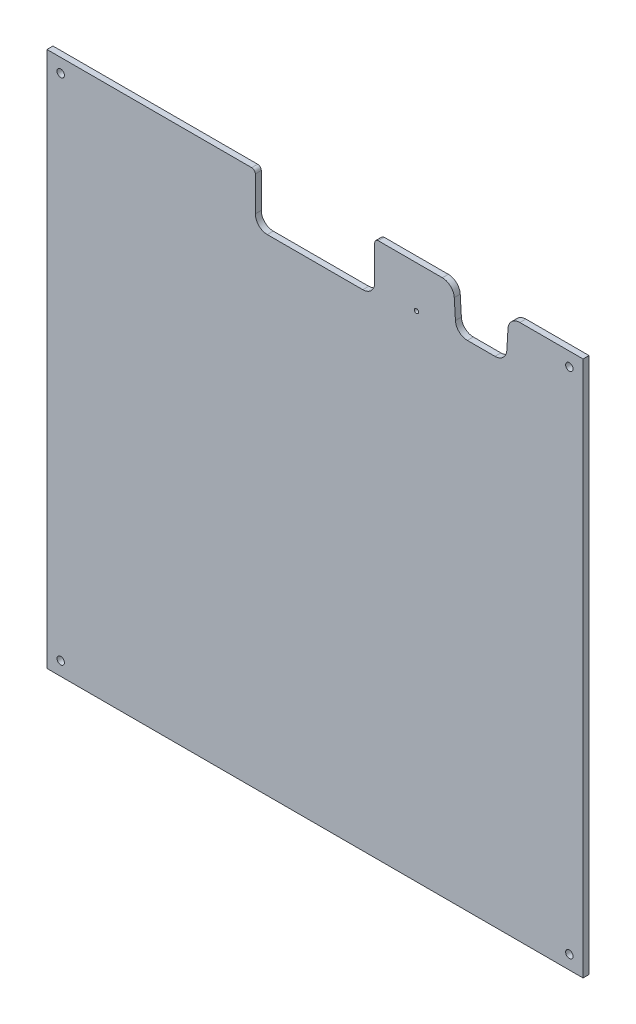
ISO-10303-21;
HEADER;
FILE_DESCRIPTION(('STEP AP214'),'2;1');
FILE_NAME('part.step','',(''),(''),'','','');
FILE_SCHEMA(('AUTOMOTIVE_DESIGN { 1 0 10303 214 1 1 1 1 }'));
ENDSEC;
DATA;
#1=APPLICATION_CONTEXT('core data for automotive mechanical design processes');
#2=APPLICATION_PROTOCOL_DEFINITION('international standard','automotive_design',2000,#1);
#3=PRODUCT_CONTEXT('',#1,'mechanical');
#4=PRODUCT('Part','Part','',(#3));
#5=PRODUCT_RELATED_PRODUCT_CATEGORY('part','',(#4));
#6=PRODUCT_DEFINITION_FORMATION('','',#4);
#7=PRODUCT_DEFINITION_CONTEXT('part definition',#1,'design');
#8=PRODUCT_DEFINITION('design','',#6,#7);
#9=PRODUCT_DEFINITION_SHAPE('','',#8);
#10=(LENGTH_UNIT() NAMED_UNIT(*) SI_UNIT(.MILLI.,.METRE.));
#11=(NAMED_UNIT(*) PLANE_ANGLE_UNIT() SI_UNIT($,.RADIAN.));
#12=(NAMED_UNIT(*) SI_UNIT($,.STERADIAN.) SOLID_ANGLE_UNIT());
#13=UNCERTAINTY_MEASURE_WITH_UNIT(LENGTH_MEASURE(1.E-05),#10,'distance_accuracy_value','');
#14=(GEOMETRIC_REPRESENTATION_CONTEXT(3) GLOBAL_UNCERTAINTY_ASSIGNED_CONTEXT((#13)) GLOBAL_UNIT_ASSIGNED_CONTEXT((#10,
#11,#12)) REPRESENTATION_CONTEXT('',''));
#15=CARTESIAN_POINT('',(0.,0.,0.));
#16=DIRECTION('',(0.,0.,1.));
#17=DIRECTION('',(1.,0.,0.));
#18=AXIS2_PLACEMENT_3D('',#15,#16,#17);
#19=CARTESIAN_POINT('',(171.5,446.,5.));
#20=DIRECTION('',(0.,0.,1.));
#21=DIRECTION('',(1.,0.,0.));
#22=AXIS2_PLACEMENT_3D('',#19,#20,#21);
#23=PLANE('',#22);
#24=CARTESIAN_POINT('',(11.5,437.5,5.));
#25=DIRECTION('',(0.,0.,1.));
#26=DIRECTION('',(-1.,0.,0.));
#27=AXIS2_PLACEMENT_3D('',#24,#25,#26);
#28=CIRCLE('',#27,3.1);
#29=CARTESIAN_POINT('',(8.4,437.5,5.));
#30=VERTEX_POINT('',#29);
#31=EDGE_CURVE('E490',#30,#30,#28,.T.);
#32=ORIENTED_EDGE('',*,*,#31,.F.);
#33=EDGE_LOOP('',(#32));
#34=FACE_BOUND('',#33,.T.);
#35=CARTESIAN_POINT('',(437.5,11.5,5.));
#36=DIRECTION('',(0.,0.,1.));
#37=DIRECTION('',(-1.,0.,0.));
#38=AXIS2_PLACEMENT_3D('',#35,#36,#37);
#39=CIRCLE('',#38,3.09999999999999);
#40=CARTESIAN_POINT('',(434.4,11.5,5.));
#41=VERTEX_POINT('',#40);
#42=EDGE_CURVE('E503',#41,#41,#39,.T.);
#43=ORIENTED_EDGE('',*,*,#42,.F.);
#44=EDGE_LOOP('',(#43));
#45=FACE_BOUND('',#44,.T.);
#46=DIRECTION('',(1.,0.,0.));
#47=VECTOR('',#46,1.);
#48=CARTESIAN_POINT('',(449.,0.,5.));
#49=LINE('',#48,#47);
#50=CARTESIAN_POINT('',(0.,0.,5.));
#51=VERTEX_POINT('',#50);
#52=CARTESIAN_POINT('',(449.,0.,5.));
#53=VERTEX_POINT('',#52);
#54=EDGE_CURVE('E293',#51,#53,#49,.T.);
#55=ORIENTED_EDGE('',*,*,#54,.T.);
#56=DIRECTION('',(0.,1.,0.));
#57=VECTOR('',#56,1.);
#58=CARTESIAN_POINT('',(449.,449.,5.));
#59=LINE('',#58,#57);
#60=CARTESIAN_POINT('',(449.,449.,5.));
#61=VERTEX_POINT('',#60);
#62=EDGE_CURVE('E145',#53,#61,#59,.T.);
#63=ORIENTED_EDGE('',*,*,#62,.T.);
#64=DIRECTION('',(-1.,0.,0.));
#65=VECTOR('',#64,1.);
#66=CARTESIAN_POINT('',(396.110585001908,449.,5.));
#67=LINE('',#66,#65);
#68=CARTESIAN_POINT('',(396.110585001908,449.,5.));
#69=VERTEX_POINT('',#68);
#70=EDGE_CURVE('E362',#61,#69,#67,.T.);
#71=ORIENTED_EDGE('',*,*,#70,.T.);
#72=CARTESIAN_POINT('',(396.110585001908,439.,5.));
#73=DIRECTION('',(0.,0.,1.));
#74=DIRECTION('',(-1.,0.,0.));
#75=AXIS2_PLACEMENT_3D('',#72,#73,#74);
#76=CIRCLE('',#75,10.);
#77=CARTESIAN_POINT('',(386.128274438066,439.594538314174,5.));
#78=VERTEX_POINT('',#77);
#79=EDGE_CURVE('E382',#69,#78,#76,.T.);
#80=ORIENTED_EDGE('',*,*,#79,.T.);
#81=DIRECTION('',(-0.059453831417346,-0.998231056384141,0.));
#82=VECTOR('',#81,1.);
#83=CARTESIAN_POINT('',(386.128274438066,439.594538314174,5.));
#84=LINE('',#83,#82);
#85=CARTESIAN_POINT('',(385.164066175351,423.405461685827,5.));
#86=VERTEX_POINT('',#85);
#87=EDGE_CURVE('E378',#78,#86,#84,.T.);
#88=ORIENTED_EDGE('',*,*,#87,.T.);
#89=CARTESIAN_POINT('',(375.18175561151,424.,5.));
#90=DIRECTION('',(0.,0.,-1.));
#91=DIRECTION('',(1.,0.,0.));
#92=AXIS2_PLACEMENT_3D('',#89,#90,#91);
#93=CIRCLE('',#92,9.99999999999998);
#94=CARTESIAN_POINT('',(375.18175561151,414.,5.));
#95=VERTEX_POINT('',#94);
#96=EDGE_CURVE('E381',#86,#95,#93,.T.);
#97=ORIENTED_EDGE('',*,*,#96,.T.);
#98=DIRECTION('',(-1.,0.,0.));
#99=VECTOR('',#98,1.);
#100=CARTESIAN_POINT('',(352.074793264622,414.,5.));
#101=LINE('',#100,#99);
#102=CARTESIAN_POINT('',(352.074793264622,414.,5.));
#103=VERTEX_POINT('',#102);
#104=EDGE_CURVE('E386',#95,#103,#101,.T.);
#105=ORIENTED_EDGE('',*,*,#104,.T.);
#106=CARTESIAN_POINT('',(352.074793264622,424.,5.));
#107=DIRECTION('',(0.,0.,-1.));
#108=DIRECTION('',(1.,0.,0.));
#109=AXIS2_PLACEMENT_3D('',#106,#107,#108);
#110=CIRCLE('',#109,9.99999999999998);
#111=CARTESIAN_POINT('',(342.092482700781,423.405461685827,5.));
#112=VERTEX_POINT('',#111);
#113=EDGE_CURVE('E456',#103,#112,#110,.T.);
#114=ORIENTED_EDGE('',*,*,#113,.T.);
#115=DIRECTION('',(-0.0594538314173494,0.998231056384141,0.));
#116=VECTOR('',#115,1.);
#117=CARTESIAN_POINT('',(341.128274438066,439.594538314174,5.));
#118=LINE('',#117,#116);
#119=CARTESIAN_POINT('',(341.128274438066,439.594538314174,5.));
#120=VERTEX_POINT('',#119);
#121=EDGE_CURVE('E447',#112,#120,#118,.T.);
#122=ORIENTED_EDGE('',*,*,#121,.T.);
#123=CARTESIAN_POINT('',(331.145963874225,439.,5.));
#124=DIRECTION('',(0.,0.,1.));
#125=DIRECTION('',(1.,0.,0.));
#126=AXIS2_PLACEMENT_3D('',#123,#124,#125);
#127=CIRCLE('',#126,10.);
#128=CARTESIAN_POINT('',(331.145963874225,449.,5.));
#129=VERTEX_POINT('',#128);
#130=EDGE_CURVE('E443',#120,#129,#127,.T.);
#131=ORIENTED_EDGE('',*,*,#130,.T.);
#132=DIRECTION('',(-1.,0.,0.));
#133=VECTOR('',#132,1.);
#134=CARTESIAN_POINT('',(277.5,449.,5.));
#135=LINE('',#134,#133);
#136=CARTESIAN_POINT('',(277.5,449.,5.));
#137=VERTEX_POINT('',#136);
#138=EDGE_CURVE('E446',#129,#137,#135,.T.);
#139=ORIENTED_EDGE('',*,*,#138,.T.);
#140=CARTESIAN_POINT('',(277.5,446.,5.));
#141=DIRECTION('',(0.,0.,1.));
#142=DIRECTION('',(1.,0.,0.));
#143=AXIS2_PLACEMENT_3D('',#140,#141,#142);
#144=CIRCLE('',#143,3.);
#145=CARTESIAN_POINT('',(274.5,446.,5.));
#146=VERTEX_POINT('',#145);
#147=EDGE_CURVE('E412',#137,#146,#144,.T.);
#148=ORIENTED_EDGE('',*,*,#147,.T.);
#149=DIRECTION('',(0.,-1.,0.));
#150=VECTOR('',#149,1.);
#151=CARTESIAN_POINT('',(274.5,417.,5.));
#152=LINE('',#151,#150);
#153=CARTESIAN_POINT('',(274.5,417.,5.));
#154=VERTEX_POINT('',#153);
#155=EDGE_CURVE('E407',#146,#154,#152,.T.);
#156=ORIENTED_EDGE('',*,*,#155,.T.);
#157=CARTESIAN_POINT('',(264.5,417.,5.));
#158=DIRECTION('',(0.,0.,-1.));
#159=DIRECTION('',(-1.,0.,0.));
#160=AXIS2_PLACEMENT_3D('',#157,#158,#159);
#161=CIRCLE('',#160,10.);
#162=CARTESIAN_POINT('',(264.5,407.,5.));
#163=VERTEX_POINT('',#162);
#164=EDGE_CURVE('E411',#154,#163,#161,.T.);
#165=ORIENTED_EDGE('',*,*,#164,.T.);
#166=DIRECTION('',(-1.,0.,0.));
#167=VECTOR('',#166,1.);
#168=CARTESIAN_POINT('',(184.5,407.,5.));
#169=LINE('',#168,#167);
#170=CARTESIAN_POINT('',(184.5,407.,5.));
#171=VERTEX_POINT('',#170);
#172=EDGE_CURVE('E426',#163,#171,#169,.T.);
#173=ORIENTED_EDGE('',*,*,#172,.T.);
#174=CARTESIAN_POINT('',(184.5,417.,5.));
#175=DIRECTION('',(0.,0.,-1.));
#176=DIRECTION('',(1.,0.,0.));
#177=AXIS2_PLACEMENT_3D('',#174,#175,#176);
#178=CIRCLE('',#177,10.);
#179=CARTESIAN_POINT('',(174.5,417.,5.));
#180=VERTEX_POINT('',#179);
#181=EDGE_CURVE('E429',#171,#180,#178,.T.);
#182=ORIENTED_EDGE('',*,*,#181,.T.);
#183=DIRECTION('',(0.,1.,0.));
#184=VECTOR('',#183,1.);
#185=CARTESIAN_POINT('',(174.5,446.,5.));
#186=LINE('',#185,#184);
#187=CARTESIAN_POINT('',(174.5,446.,5.));
#188=VERTEX_POINT('',#187);
#189=EDGE_CURVE('E212',#180,#188,#186,.T.);
#190=ORIENTED_EDGE('',*,*,#189,.T.);
#191=CARTESIAN_POINT('',(171.5,446.,5.));
#192=DIRECTION('',(0.,0.,1.));
#193=DIRECTION('',(1.,0.,0.));
#194=AXIS2_PLACEMENT_3D('',#191,#192,#193);
#195=CIRCLE('',#194,2.99999999999998);
#196=CARTESIAN_POINT('',(171.5,449.,5.));
#197=VERTEX_POINT('',#196);
#198=EDGE_CURVE('E206',#188,#197,#195,.T.);
#199=ORIENTED_EDGE('',*,*,#198,.T.);
#200=DIRECTION('',(-1.,0.,0.));
#201=VECTOR('',#200,1.);
#202=CARTESIAN_POINT('',(0.,449.,5.));
#203=LINE('',#202,#201);
#204=CARTESIAN_POINT('',(0.,449.,5.));
#205=VERTEX_POINT('',#204);
#206=EDGE_CURVE('E210',#197,#205,#203,.T.);
#207=ORIENTED_EDGE('',*,*,#206,.T.);
#208=DIRECTION('',(0.,-1.,0.));
#209=VECTOR('',#208,1.);
#210=CARTESIAN_POINT('',(0.,0.,5.));
#211=LINE('',#210,#209);
#212=EDGE_CURVE('E66',#205,#51,#211,.T.);
#213=ORIENTED_EDGE('',*,*,#212,.T.);
#214=EDGE_LOOP('',(#55,#63,#71,#80,#88,#97,#105,#114,#122,#131,#139,#148,#156,#165,#173,#182,
#190,#199,#207,#213));
#215=FACE_BOUND('',#214,.T.);
#216=CARTESIAN_POINT('',(11.5,11.5,5.));
#217=DIRECTION('',(0.,0.,1.));
#218=DIRECTION('',(1.,0.,0.));
#219=AXIS2_PLACEMENT_3D('',#216,#217,#218);
#220=CIRCLE('',#219,3.1);
#221=CARTESIAN_POINT('',(14.6,11.5,5.));
#222=VERTEX_POINT('',#221);
#223=EDGE_CURVE('E239',#222,#222,#220,.T.);
#224=ORIENTED_EDGE('',*,*,#223,.F.);
#225=EDGE_LOOP('',(#224));
#226=FACE_BOUND('',#225,.T.);
#227=CARTESIAN_POINT('',(437.5,437.5,5.));
#228=DIRECTION('',(0.,0.,1.));
#229=DIRECTION('',(1.,0.,0.));
#230=AXIS2_PLACEMENT_3D('',#227,#228,#229);
#231=CIRCLE('',#230,3.09999999999999);
#232=CARTESIAN_POINT('',(440.6,437.5,5.));
#233=VERTEX_POINT('',#232);
#234=EDGE_CURVE('E495',#233,#233,#231,.T.);
#235=ORIENTED_EDGE('',*,*,#234,.F.);
#236=EDGE_LOOP('',(#235));
#237=FACE_BOUND('',#236,.T.);
#238=CARTESIAN_POINT('',(309.5,414.,5.));
#239=DIRECTION('',(0.,0.,1.));
#240=DIRECTION('',(1.,0.,0.));
#241=AXIS2_PLACEMENT_3D('',#238,#239,#240);
#242=CIRCLE('',#241,1.74999999999998);
#243=CARTESIAN_POINT('',(311.25,414.,5.));
#244=VERTEX_POINT('',#243);
#245=EDGE_CURVE('E485',#244,#244,#242,.T.);
#246=ORIENTED_EDGE('',*,*,#245,.F.);
#247=EDGE_LOOP('',(#246));
#248=FACE_BOUND('',#247,.T.);
#249=ADVANCED_FACE('F45',(#34,#45,#215,#226,#237,#248),#23,.T.);
#250=CARTESIAN_POINT('',(171.5,446.,0.));
#251=DIRECTION('',(0.,0.,1.));
#252=DIRECTION('',(1.,0.,0.));
#253=AXIS2_PLACEMENT_3D('',#250,#251,#252);
#254=PLANE('',#253);
#255=DIRECTION('',(1.,0.,0.));
#256=VECTOR('',#255,1.);
#257=CARTESIAN_POINT('',(449.,0.,0.));
#258=LINE('',#257,#256);
#259=CARTESIAN_POINT('',(0.,0.,0.));
#260=VERTEX_POINT('',#259);
#261=CARTESIAN_POINT('',(449.,0.,0.));
#262=VERTEX_POINT('',#261);
#263=EDGE_CURVE('E234',#260,#262,#258,.T.);
#264=ORIENTED_EDGE('',*,*,#263,.F.);
#265=DIRECTION('',(0.,-1.,0.));
#266=VECTOR('',#265,1.);
#267=CARTESIAN_POINT('',(0.,0.,0.));
#268=LINE('',#267,#266);
#269=CARTESIAN_POINT('',(0.,449.,0.));
#270=VERTEX_POINT('',#269);
#271=EDGE_CURVE('E137',#270,#260,#268,.T.);
#272=ORIENTED_EDGE('',*,*,#271,.F.);
#273=DIRECTION('',(-1.,0.,0.));
#274=VECTOR('',#273,1.);
#275=CARTESIAN_POINT('',(0.,449.,0.));
#276=LINE('',#275,#274);
#277=CARTESIAN_POINT('',(171.5,449.,0.));
#278=VERTEX_POINT('',#277);
#279=EDGE_CURVE('E131',#278,#270,#276,.T.);
#280=ORIENTED_EDGE('',*,*,#279,.F.);
#281=CARTESIAN_POINT('',(171.5,446.,0.));
#282=DIRECTION('',(0.,0.,1.));
#283=DIRECTION('',(1.,0.,0.));
#284=AXIS2_PLACEMENT_3D('',#281,#282,#283);
#285=CIRCLE('',#284,2.99999999999998);
#286=CARTESIAN_POINT('',(174.5,446.,0.));
#287=VERTEX_POINT('',#286);
#288=EDGE_CURVE('E221',#287,#278,#285,.T.);
#289=ORIENTED_EDGE('',*,*,#288,.F.);
#290=DIRECTION('',(0.,1.,0.));
#291=VECTOR('',#290,1.);
#292=CARTESIAN_POINT('',(174.5,446.,0.));
#293=LINE('',#292,#291);
#294=CARTESIAN_POINT('',(174.5,417.,0.));
#295=VERTEX_POINT('',#294);
#296=EDGE_CURVE('E284',#295,#287,#293,.T.);
#297=ORIENTED_EDGE('',*,*,#296,.F.);
#298=CARTESIAN_POINT('',(184.5,417.,0.));
#299=DIRECTION('',(0.,0.,-1.));
#300=DIRECTION('',(1.,0.,0.));
#301=AXIS2_PLACEMENT_3D('',#298,#299,#300);
#302=CIRCLE('',#301,10.);
#303=CARTESIAN_POINT('',(184.5,407.,0.));
#304=VERTEX_POINT('',#303);
#305=EDGE_CURVE('E281',#304,#295,#302,.T.);
#306=ORIENTED_EDGE('',*,*,#305,.F.);
#307=DIRECTION('',(-1.,0.,0.));
#308=VECTOR('',#307,1.);
#309=CARTESIAN_POINT('',(184.5,407.,0.));
#310=LINE('',#309,#308);
#311=CARTESIAN_POINT('',(264.5,407.,0.));
#312=VERTEX_POINT('',#311);
#313=EDGE_CURVE('E278',#312,#304,#310,.T.);
#314=ORIENTED_EDGE('',*,*,#313,.F.);
#315=CARTESIAN_POINT('',(264.5,417.,0.));
#316=DIRECTION('',(0.,0.,-1.));
#317=DIRECTION('',(-1.,0.,0.));
#318=AXIS2_PLACEMENT_3D('',#315,#316,#317);
#319=CIRCLE('',#318,10.);
#320=CARTESIAN_POINT('',(274.5,417.,0.));
#321=VERTEX_POINT('',#320);
#322=EDGE_CURVE('E275',#321,#312,#319,.T.);
#323=ORIENTED_EDGE('',*,*,#322,.F.);
#324=DIRECTION('',(0.,-1.,0.));
#325=VECTOR('',#324,1.);
#326=CARTESIAN_POINT('',(274.5,417.,0.));
#327=LINE('',#326,#325);
#328=CARTESIAN_POINT('',(274.5,446.,0.));
#329=VERTEX_POINT('',#328);
#330=EDGE_CURVE('E272',#329,#321,#327,.T.);
#331=ORIENTED_EDGE('',*,*,#330,.F.);
#332=CARTESIAN_POINT('',(277.5,446.,0.));
#333=DIRECTION('',(0.,0.,1.));
#334=DIRECTION('',(1.,0.,0.));
#335=AXIS2_PLACEMENT_3D('',#332,#333,#334);
#336=CIRCLE('',#335,3.);
#337=CARTESIAN_POINT('',(277.5,449.,0.));
#338=VERTEX_POINT('',#337);
#339=EDGE_CURVE('E269',#338,#329,#336,.T.);
#340=ORIENTED_EDGE('',*,*,#339,.F.);
#341=DIRECTION('',(-1.,0.,0.));
#342=VECTOR('',#341,1.);
#343=CARTESIAN_POINT('',(277.5,449.,0.));
#344=LINE('',#343,#342);
#345=CARTESIAN_POINT('',(331.145963874225,449.,0.));
#346=VERTEX_POINT('',#345);
#347=EDGE_CURVE('E266',#346,#338,#344,.T.);
#348=ORIENTED_EDGE('',*,*,#347,.F.);
#349=CARTESIAN_POINT('',(331.145963874225,439.,0.));
#350=DIRECTION('',(0.,0.,1.));
#351=DIRECTION('',(1.,0.,0.));
#352=AXIS2_PLACEMENT_3D('',#349,#350,#351);
#353=CIRCLE('',#352,10.);
#354=CARTESIAN_POINT('',(341.128274438066,439.594538314174,0.));
#355=VERTEX_POINT('',#354);
#356=EDGE_CURVE('E263',#355,#346,#353,.T.);
#357=ORIENTED_EDGE('',*,*,#356,.F.);
#358=DIRECTION('',(-0.0594538314173494,0.998231056384141,0.));
#359=VECTOR('',#358,1.);
#360=CARTESIAN_POINT('',(341.128274438066,439.594538314174,0.));
#361=LINE('',#360,#359);
#362=CARTESIAN_POINT('',(342.092482700781,423.405461685827,0.));
#363=VERTEX_POINT('',#362);
#364=EDGE_CURVE('E260',#363,#355,#361,.T.);
#365=ORIENTED_EDGE('',*,*,#364,.F.);
#366=CARTESIAN_POINT('',(352.074793264622,424.,0.));
#367=DIRECTION('',(0.,0.,-1.));
#368=DIRECTION('',(1.,0.,0.));
#369=AXIS2_PLACEMENT_3D('',#366,#367,#368);
#370=CIRCLE('',#369,9.99999999999998);
#371=CARTESIAN_POINT('',(352.074793264622,414.,0.));
#372=VERTEX_POINT('',#371);
#373=EDGE_CURVE('E257',#372,#363,#370,.T.);
#374=ORIENTED_EDGE('',*,*,#373,.F.);
#375=DIRECTION('',(-1.,0.,0.));
#376=VECTOR('',#375,1.);
#377=CARTESIAN_POINT('',(352.074793264622,414.,0.));
#378=LINE('',#377,#376);
#379=CARTESIAN_POINT('',(375.18175561151,414.,0.));
#380=VERTEX_POINT('',#379);
#381=EDGE_CURVE('E254',#380,#372,#378,.T.);
#382=ORIENTED_EDGE('',*,*,#381,.F.);
#383=CARTESIAN_POINT('',(375.18175561151,424.,0.));
#384=DIRECTION('',(0.,0.,-1.));
#385=DIRECTION('',(1.,0.,0.));
#386=AXIS2_PLACEMENT_3D('',#383,#384,#385);
#387=CIRCLE('',#386,9.99999999999998);
#388=CARTESIAN_POINT('',(385.164066175351,423.405461685827,0.));
#389=VERTEX_POINT('',#388);
#390=EDGE_CURVE('E251',#389,#380,#387,.T.);
#391=ORIENTED_EDGE('',*,*,#390,.F.);
#392=DIRECTION('',(-0.059453831417346,-0.998231056384141,0.));
#393=VECTOR('',#392,1.);
#394=CARTESIAN_POINT('',(386.128274438066,439.594538314174,0.));
#395=LINE('',#394,#393);
#396=CARTESIAN_POINT('',(386.128274438066,439.594538314174,0.));
#397=VERTEX_POINT('',#396);
#398=EDGE_CURVE('E248',#397,#389,#395,.T.);
#399=ORIENTED_EDGE('',*,*,#398,.F.);
#400=CARTESIAN_POINT('',(396.110585001908,439.,0.));
#401=DIRECTION('',(0.,0.,1.));
#402=DIRECTION('',(-1.,0.,0.));
#403=AXIS2_PLACEMENT_3D('',#400,#401,#402);
#404=CIRCLE('',#403,10.);
#405=CARTESIAN_POINT('',(396.110585001908,449.,0.));
#406=VERTEX_POINT('',#405);
#407=EDGE_CURVE('E245',#406,#397,#404,.T.);
#408=ORIENTED_EDGE('',*,*,#407,.F.);
#409=DIRECTION('',(-1.,0.,0.));
#410=VECTOR('',#409,1.);
#411=CARTESIAN_POINT('',(396.110585001908,449.,0.));
#412=LINE('',#411,#410);
#413=CARTESIAN_POINT('',(449.,449.,0.));
#414=VERTEX_POINT('',#413);
#415=EDGE_CURVE('E242',#414,#406,#412,.T.);
#416=ORIENTED_EDGE('',*,*,#415,.F.);
#417=DIRECTION('',(0.,1.,0.));
#418=VECTOR('',#417,1.);
#419=CARTESIAN_POINT('',(449.,449.,0.));
#420=LINE('',#419,#418);
#421=EDGE_CURVE('E238',#262,#414,#420,.T.);
#422=ORIENTED_EDGE('',*,*,#421,.F.);
#423=EDGE_LOOP('',(#264,#272,#280,#289,#297,#306,#314,#323,#331,#340,#348,#357,#365,#374,#382,
#391,#399,#408,#416,#422));
#424=FACE_BOUND('',#423,.T.);
#425=CARTESIAN_POINT('',(11.5,11.5,0.));
#426=DIRECTION('',(0.,0.,1.));
#427=DIRECTION('',(1.,0.,0.));
#428=AXIS2_PLACEMENT_3D('',#425,#426,#427);
#429=CIRCLE('',#428,3.1);
#430=CARTESIAN_POINT('',(14.6,11.5,0.));
#431=VERTEX_POINT('',#430);
#432=EDGE_CURVE('E642',#431,#431,#429,.T.);
#433=ORIENTED_EDGE('',*,*,#432,.T.);
#434=EDGE_LOOP('',(#433));
#435=FACE_BOUND('',#434,.T.);
#436=CARTESIAN_POINT('',(437.5,11.5,0.));
#437=DIRECTION('',(0.,0.,1.));
#438=DIRECTION('',(-1.,0.,0.));
#439=AXIS2_PLACEMENT_3D('',#436,#437,#438);
#440=CIRCLE('',#439,3.09999999999999);
#441=CARTESIAN_POINT('',(434.4,11.5,0.));
#442=VERTEX_POINT('',#441);
#443=EDGE_CURVE('E497',#442,#442,#440,.T.);
#444=ORIENTED_EDGE('',*,*,#443,.T.);
#445=EDGE_LOOP('',(#444));
#446=FACE_BOUND('',#445,.T.);
#447=CARTESIAN_POINT('',(437.5,437.5,0.));
#448=DIRECTION('',(0.,0.,1.));
#449=DIRECTION('',(1.,0.,0.));
#450=AXIS2_PLACEMENT_3D('',#447,#448,#449);
#451=CIRCLE('',#450,3.09999999999999);
#452=CARTESIAN_POINT('',(440.6,437.5,0.));
#453=VERTEX_POINT('',#452);
#454=EDGE_CURVE('E493',#453,#453,#451,.T.);
#455=ORIENTED_EDGE('',*,*,#454,.T.);
#456=EDGE_LOOP('',(#455));
#457=FACE_BOUND('',#456,.T.);
#458=CARTESIAN_POINT('',(11.5,437.5,0.));
#459=DIRECTION('',(0.,0.,1.));
#460=DIRECTION('',(-1.,0.,0.));
#461=AXIS2_PLACEMENT_3D('',#458,#459,#460);
#462=CIRCLE('',#461,3.1);
#463=CARTESIAN_POINT('',(8.4,437.5,0.));
#464=VERTEX_POINT('',#463);
#465=EDGE_CURVE('E488',#464,#464,#462,.T.);
#466=ORIENTED_EDGE('',*,*,#465,.T.);
#467=EDGE_LOOP('',(#466));
#468=FACE_BOUND('',#467,.T.);
#469=CARTESIAN_POINT('',(309.5,414.,0.));
#470=DIRECTION('',(0.,0.,1.));
#471=DIRECTION('',(1.,0.,0.));
#472=AXIS2_PLACEMENT_3D('',#469,#470,#471);
#473=CIRCLE('',#472,1.74999999999998);
#474=CARTESIAN_POINT('',(311.25,414.,0.));
#475=VERTEX_POINT('',#474);
#476=EDGE_CURVE('E489',#475,#475,#473,.T.);
#477=ORIENTED_EDGE('',*,*,#476,.T.);
#478=EDGE_LOOP('',(#477));
#479=FACE_BOUND('',#478,.T.);
#480=ADVANCED_FACE('F366',(#424,#435,#446,#457,#468,#479),#254,.F.);
#481=CARTESIAN_POINT('',(449.,0.,5.));
#482=DIRECTION('',(0.,1.,0.));
#483=DIRECTION('',(0.,0.,1.));
#484=AXIS2_PLACEMENT_3D('',#481,#482,#483);
#485=PLANE('',#484);
#486=ORIENTED_EDGE('',*,*,#263,.T.);
#487=DIRECTION('',(0.,0.,-1.));
#488=VECTOR('',#487,1.);
#489=CARTESIAN_POINT('',(449.,0.,5.));
#490=LINE('',#489,#488);
#491=EDGE_CURVE('E12',#53,#262,#490,.T.);
#492=ORIENTED_EDGE('',*,*,#491,.F.);
#493=ORIENTED_EDGE('',*,*,#54,.F.);
#494=DIRECTION('',(0.,0.,-1.));
#495=VECTOR('',#494,1.);
#496=CARTESIAN_POINT('',(0.,0.,5.));
#497=LINE('',#496,#495);
#498=EDGE_CURVE('E230',#51,#260,#497,.T.);
#499=ORIENTED_EDGE('',*,*,#498,.T.);
#500=EDGE_LOOP('',(#486,#492,#493,#499));
#501=FACE_BOUND('',#500,.T.);
#502=ADVANCED_FACE('F47',(#501),#485,.F.);
#503=CARTESIAN_POINT('',(449.,449.,5.));
#504=DIRECTION('',(-1.,0.,0.));
#505=DIRECTION('',(0.,-1.,0.));
#506=AXIS2_PLACEMENT_3D('',#503,#504,#505);
#507=PLANE('',#506);
#508=ORIENTED_EDGE('',*,*,#421,.T.);
#509=DIRECTION('',(0.,0.,-1.));
#510=VECTOR('',#509,1.);
#511=CARTESIAN_POINT('',(449.,449.,5.));
#512=LINE('',#511,#510);
#513=EDGE_CURVE('E55',#61,#414,#512,.T.);
#514=ORIENTED_EDGE('',*,*,#513,.F.);
#515=ORIENTED_EDGE('',*,*,#62,.F.);
#516=ORIENTED_EDGE('',*,*,#491,.T.);
#517=EDGE_LOOP('',(#508,#514,#515,#516));
#518=FACE_BOUND('',#517,.T.);
#519=ADVANCED_FACE('F603',(#518),#507,.F.);
#520=CARTESIAN_POINT('',(396.110585001908,449.,5.));
#521=DIRECTION('',(0.,-1.,0.));
#522=DIRECTION('',(0.,0.,-1.));
#523=AXIS2_PLACEMENT_3D('',#520,#521,#522);
#524=PLANE('',#523);
#525=ORIENTED_EDGE('',*,*,#415,.T.);
#526=DIRECTION('',(0.,0.,-1.));
#527=VECTOR('',#526,1.);
#528=CARTESIAN_POINT('',(396.110585001908,449.,5.));
#529=LINE('',#528,#527);
#530=EDGE_CURVE('E352',#69,#406,#529,.T.);
#531=ORIENTED_EDGE('',*,*,#530,.F.);
#532=ORIENTED_EDGE('',*,*,#70,.F.);
#533=ORIENTED_EDGE('',*,*,#513,.T.);
#534=EDGE_LOOP('',(#525,#531,#532,#533));
#535=FACE_BOUND('',#534,.T.);
#536=ADVANCED_FACE('F360',(#535),#524,.F.);
#537=CARTESIAN_POINT('',(396.110585001908,439.,5.));
#538=DIRECTION('',(0.,0.,-1.));
#539=DIRECTION('',(-1.,0.,0.));
#540=AXIS2_PLACEMENT_3D('',#537,#538,#539);
#541=CYLINDRICAL_SURFACE('',#540,10.);
#542=ORIENTED_EDGE('',*,*,#407,.T.);
#543=DIRECTION('',(0.,0.,-1.));
#544=VECTOR('',#543,1.);
#545=CARTESIAN_POINT('',(386.128274438066,439.594538314174,5.));
#546=LINE('',#545,#544);
#547=EDGE_CURVE('E348',#78,#397,#546,.T.);
#548=ORIENTED_EDGE('',*,*,#547,.F.);
#549=ORIENTED_EDGE('',*,*,#79,.F.);
#550=ORIENTED_EDGE('',*,*,#530,.T.);
#551=EDGE_LOOP('',(#542,#548,#549,#550));
#552=FACE_BOUND('',#551,.T.);
#553=ADVANCED_FACE('F372',(#552),#541,.T.);
#554=CARTESIAN_POINT('',(386.128274438066,439.594538314174,5.));
#555=DIRECTION('',(0.998231056384141,-0.059453831417346,0.));
#556=DIRECTION('',(0.059453831417346,0.998231056384141,0.));
#557=AXIS2_PLACEMENT_3D('',#554,#555,#556);
#558=PLANE('',#557);
#559=ORIENTED_EDGE('',*,*,#398,.T.);
#560=DIRECTION('',(0.,0.,-1.));
#561=VECTOR('',#560,1.);
#562=CARTESIAN_POINT('',(385.164066175351,423.405461685827,5.));
#563=LINE('',#562,#561);
#564=EDGE_CURVE('E344',#86,#389,#563,.T.);
#565=ORIENTED_EDGE('',*,*,#564,.F.);
#566=ORIENTED_EDGE('',*,*,#87,.F.);
#567=ORIENTED_EDGE('',*,*,#547,.T.);
#568=EDGE_LOOP('',(#559,#565,#566,#567));
#569=FACE_BOUND('',#568,.T.);
#570=ADVANCED_FACE('F376',(#569),#558,.F.);
#571=CARTESIAN_POINT('',(375.18175561151,424.,5.));
#572=DIRECTION('',(0.,0.,-1.));
#573=DIRECTION('',(-1.,0.,0.));
#574=AXIS2_PLACEMENT_3D('',#571,#572,#573);
#575=CYLINDRICAL_SURFACE('',#574,9.99999999999998);
#576=ORIENTED_EDGE('',*,*,#390,.T.);
#577=DIRECTION('',(0.,0.,-1.));
#578=VECTOR('',#577,1.);
#579=CARTESIAN_POINT('',(375.18175561151,414.,5.));
#580=LINE('',#579,#578);
#581=EDGE_CURVE('E340',#95,#380,#580,.T.);
#582=ORIENTED_EDGE('',*,*,#581,.F.);
#583=ORIENTED_EDGE('',*,*,#96,.F.);
#584=ORIENTED_EDGE('',*,*,#564,.T.);
#585=EDGE_LOOP('',(#576,#582,#583,#584));
#586=FACE_BOUND('',#585,.T.);
#587=ADVANCED_FACE('F594',(#586),#575,.F.);
#588=CARTESIAN_POINT('',(352.074793264622,414.,5.));
#589=DIRECTION('',(0.,-1.,0.));
#590=DIRECTION('',(0.,0.,-1.));
#591=AXIS2_PLACEMENT_3D('',#588,#589,#590);
#592=PLANE('',#591);
#593=ORIENTED_EDGE('',*,*,#381,.T.);
#594=DIRECTION('',(0.,0.,-1.));
#595=VECTOR('',#594,1.);
#596=CARTESIAN_POINT('',(352.074793264622,414.,5.));
#597=LINE('',#596,#595);
#598=EDGE_CURVE('E336',#103,#372,#597,.T.);
#599=ORIENTED_EDGE('',*,*,#598,.F.);
#600=ORIENTED_EDGE('',*,*,#104,.F.);
#601=ORIENTED_EDGE('',*,*,#581,.T.);
#602=EDGE_LOOP('',(#593,#599,#600,#601));
#603=FACE_BOUND('',#602,.T.);
#604=ADVANCED_FACE('F470',(#603),#592,.F.);
#605=CARTESIAN_POINT('',(352.074793264622,424.,5.));
#606=DIRECTION('',(0.,0.,-1.));
#607=DIRECTION('',(-1.,0.,0.));
#608=AXIS2_PLACEMENT_3D('',#605,#606,#607);
#609=CYLINDRICAL_SURFACE('',#608,9.99999999999998);
#610=ORIENTED_EDGE('',*,*,#373,.T.);
#611=DIRECTION('',(0.,0.,-1.));
#612=VECTOR('',#611,1.);
#613=CARTESIAN_POINT('',(342.092482700781,423.405461685827,5.));
#614=LINE('',#613,#612);
#615=EDGE_CURVE('E332',#112,#363,#614,.T.);
#616=ORIENTED_EDGE('',*,*,#615,.F.);
#617=ORIENTED_EDGE('',*,*,#113,.F.);
#618=ORIENTED_EDGE('',*,*,#598,.T.);
#619=EDGE_LOOP('',(#610,#616,#617,#618));
#620=FACE_BOUND('',#619,.T.);
#621=ADVANCED_FACE('F474',(#620),#609,.F.);
#622=CARTESIAN_POINT('',(341.128274438066,439.594538314174,5.));
#623=DIRECTION('',(-0.998231056384141,-0.0594538314173494,0.));
#624=DIRECTION('',(0.0594538314173494,-0.998231056384141,0.));
#625=AXIS2_PLACEMENT_3D('',#622,#623,#624);
#626=PLANE('',#625);
#627=ORIENTED_EDGE('',*,*,#364,.T.);
#628=DIRECTION('',(0.,0.,-1.));
#629=VECTOR('',#628,1.);
#630=CARTESIAN_POINT('',(341.128274438066,439.594538314174,5.));
#631=LINE('',#630,#629);
#632=EDGE_CURVE('E328',#120,#355,#631,.T.);
#633=ORIENTED_EDGE('',*,*,#632,.F.);
#634=ORIENTED_EDGE('',*,*,#121,.F.);
#635=ORIENTED_EDGE('',*,*,#615,.T.);
#636=EDGE_LOOP('',(#627,#633,#634,#635));
#637=FACE_BOUND('',#636,.T.);
#638=ADVANCED_FACE('F479',(#637),#626,.F.);
#639=CARTESIAN_POINT('',(331.145963874225,439.,5.));
#640=DIRECTION('',(0.,0.,-1.));
#641=DIRECTION('',(-1.,0.,0.));
#642=AXIS2_PLACEMENT_3D('',#639,#640,#641);
#643=CYLINDRICAL_SURFACE('',#642,10.);
#644=ORIENTED_EDGE('',*,*,#356,.T.);
#645=DIRECTION('',(0.,0.,-1.));
#646=VECTOR('',#645,1.);
#647=CARTESIAN_POINT('',(331.145963874225,449.,5.));
#648=LINE('',#647,#646);
#649=EDGE_CURVE('E324',#129,#346,#648,.T.);
#650=ORIENTED_EDGE('',*,*,#649,.F.);
#651=ORIENTED_EDGE('',*,*,#130,.F.);
#652=ORIENTED_EDGE('',*,*,#632,.T.);
#653=EDGE_LOOP('',(#644,#650,#651,#652));
#654=FACE_BOUND('',#653,.T.);
#655=ADVANCED_FACE('F583',(#654),#643,.T.);
#656=CARTESIAN_POINT('',(277.5,449.,5.));
#657=DIRECTION('',(0.,-1.,0.));
#658=DIRECTION('',(0.,0.,-1.));
#659=AXIS2_PLACEMENT_3D('',#656,#657,#658);
#660=PLANE('',#659);
#661=ORIENTED_EDGE('',*,*,#347,.T.);
#662=DIRECTION('',(0.,0.,-1.));
#663=VECTOR('',#662,1.);
#664=CARTESIAN_POINT('',(277.5,449.,5.));
#665=LINE('',#664,#663);
#666=EDGE_CURVE('E320',#137,#338,#665,.T.);
#667=ORIENTED_EDGE('',*,*,#666,.F.);
#668=ORIENTED_EDGE('',*,*,#138,.F.);
#669=ORIENTED_EDGE('',*,*,#649,.T.);
#670=EDGE_LOOP('',(#661,#667,#668,#669));
#671=FACE_BOUND('',#670,.T.);
#672=ADVANCED_FACE('F579',(#671),#660,.F.);
#673=CARTESIAN_POINT('',(277.5,446.,5.));
#674=DIRECTION('',(0.,0.,-1.));
#675=DIRECTION('',(-1.,0.,0.));
#676=AXIS2_PLACEMENT_3D('',#673,#674,#675);
#677=CYLINDRICAL_SURFACE('',#676,3.);
#678=ORIENTED_EDGE('',*,*,#339,.T.);
#679=DIRECTION('',(0.,0.,-1.));
#680=VECTOR('',#679,1.);
#681=CARTESIAN_POINT('',(274.5,446.,5.));
#682=LINE('',#681,#680);
#683=EDGE_CURVE('E316',#146,#329,#682,.T.);
#684=ORIENTED_EDGE('',*,*,#683,.F.);
#685=ORIENTED_EDGE('',*,*,#147,.F.);
#686=ORIENTED_EDGE('',*,*,#666,.T.);
#687=EDGE_LOOP('',(#678,#684,#685,#686));
#688=FACE_BOUND('',#687,.T.);
#689=ADVANCED_FACE('F575',(#688),#677,.T.);
#690=CARTESIAN_POINT('',(274.5,417.,5.));
#691=DIRECTION('',(1.,0.,0.));
#692=DIRECTION('',(0.,1.,0.));
#693=AXIS2_PLACEMENT_3D('',#690,#691,#692);
#694=PLANE('',#693);
#695=ORIENTED_EDGE('',*,*,#330,.T.);
#696=DIRECTION('',(0.,0.,-1.));
#697=VECTOR('',#696,1.);
#698=CARTESIAN_POINT('',(274.5,417.,5.));
#699=LINE('',#698,#697);
#700=EDGE_CURVE('E312',#154,#321,#699,.T.);
#701=ORIENTED_EDGE('',*,*,#700,.F.);
#702=ORIENTED_EDGE('',*,*,#155,.F.);
#703=ORIENTED_EDGE('',*,*,#683,.T.);
#704=EDGE_LOOP('',(#695,#701,#702,#703));
#705=FACE_BOUND('',#704,.T.);
#706=ADVANCED_FACE('F571',(#705),#694,.F.);
#707=CARTESIAN_POINT('',(264.5,417.,5.));
#708=DIRECTION('',(0.,0.,-1.));
#709=DIRECTION('',(-1.,0.,0.));
#710=AXIS2_PLACEMENT_3D('',#707,#708,#709);
#711=CYLINDRICAL_SURFACE('',#710,10.);
#712=ORIENTED_EDGE('',*,*,#322,.T.);
#713=DIRECTION('',(0.,0.,-1.));
#714=VECTOR('',#713,1.);
#715=CARTESIAN_POINT('',(264.5,407.,5.));
#716=LINE('',#715,#714);
#717=EDGE_CURVE('E308',#163,#312,#716,.T.);
#718=ORIENTED_EDGE('',*,*,#717,.F.);
#719=ORIENTED_EDGE('',*,*,#164,.F.);
#720=ORIENTED_EDGE('',*,*,#700,.T.);
#721=EDGE_LOOP('',(#712,#718,#719,#720));
#722=FACE_BOUND('',#721,.T.);
#723=ADVANCED_FACE('F567',(#722),#711,.F.);
#724=CARTESIAN_POINT('',(184.5,407.,5.));
#725=DIRECTION('',(0.,-1.,0.));
#726=DIRECTION('',(0.,0.,-1.));
#727=AXIS2_PLACEMENT_3D('',#724,#725,#726);
#728=PLANE('',#727);
#729=ORIENTED_EDGE('',*,*,#313,.T.);
#730=DIRECTION('',(0.,0.,-1.));
#731=VECTOR('',#730,1.);
#732=CARTESIAN_POINT('',(184.5,407.,5.));
#733=LINE('',#732,#731);
#734=EDGE_CURVE('E304',#171,#304,#733,.T.);
#735=ORIENTED_EDGE('',*,*,#734,.F.);
#736=ORIENTED_EDGE('',*,*,#172,.F.);
#737=ORIENTED_EDGE('',*,*,#717,.T.);
#738=EDGE_LOOP('',(#729,#735,#736,#737));
#739=FACE_BOUND('',#738,.T.);
#740=ADVANCED_FACE('F563',(#739),#728,.F.);
#741=CARTESIAN_POINT('',(184.5,417.,5.));
#742=DIRECTION('',(0.,0.,-1.));
#743=DIRECTION('',(-1.,0.,0.));
#744=AXIS2_PLACEMENT_3D('',#741,#742,#743);
#745=CYLINDRICAL_SURFACE('',#744,10.);
#746=ORIENTED_EDGE('',*,*,#305,.T.);
#747=DIRECTION('',(0.,0.,-1.));
#748=VECTOR('',#747,1.);
#749=CARTESIAN_POINT('',(174.5,417.,5.));
#750=LINE('',#749,#748);
#751=EDGE_CURVE('E300',#180,#295,#750,.T.);
#752=ORIENTED_EDGE('',*,*,#751,.F.);
#753=ORIENTED_EDGE('',*,*,#181,.F.);
#754=ORIENTED_EDGE('',*,*,#734,.T.);
#755=EDGE_LOOP('',(#746,#752,#753,#754));
#756=FACE_BOUND('',#755,.T.);
#757=ADVANCED_FACE('F559',(#756),#745,.F.);
#758=CARTESIAN_POINT('',(174.5,446.,5.));
#759=DIRECTION('',(-1.,0.,0.));
#760=DIRECTION('',(0.,-1.,0.));
#761=AXIS2_PLACEMENT_3D('',#758,#759,#760);
#762=PLANE('',#761);
#763=ORIENTED_EDGE('',*,*,#296,.T.);
#764=DIRECTION('',(0.,0.,-1.));
#765=VECTOR('',#764,1.);
#766=CARTESIAN_POINT('',(174.5,446.,5.));
#767=LINE('',#766,#765);
#768=EDGE_CURVE('E223',#188,#287,#767,.T.);
#769=ORIENTED_EDGE('',*,*,#768,.F.);
#770=ORIENTED_EDGE('',*,*,#189,.F.);
#771=ORIENTED_EDGE('',*,*,#751,.T.);
#772=EDGE_LOOP('',(#763,#769,#770,#771));
#773=FACE_BOUND('',#772,.T.);
#774=ADVANCED_FACE('F556',(#773),#762,.F.);
#775=CARTESIAN_POINT('',(171.5,446.,5.));
#776=DIRECTION('',(0.,0.,-1.));
#777=DIRECTION('',(-1.,0.,0.));
#778=AXIS2_PLACEMENT_3D('',#775,#776,#777);
#779=CYLINDRICAL_SURFACE('',#778,2.99999999999998);
#780=ORIENTED_EDGE('',*,*,#288,.T.);
#781=DIRECTION('',(0.,0.,-1.));
#782=VECTOR('',#781,1.);
#783=CARTESIAN_POINT('',(171.5,449.,5.));
#784=LINE('',#783,#782);
#785=EDGE_CURVE('E218',#197,#278,#784,.T.);
#786=ORIENTED_EDGE('',*,*,#785,.F.);
#787=ORIENTED_EDGE('',*,*,#198,.F.);
#788=ORIENTED_EDGE('',*,*,#768,.T.);
#789=EDGE_LOOP('',(#780,#786,#787,#788));
#790=FACE_BOUND('',#789,.T.);
#791=ADVANCED_FACE('F219',(#790),#779,.T.);
#792=CARTESIAN_POINT('',(0.,449.,5.));
#793=DIRECTION('',(0.,-1.,0.));
#794=DIRECTION('',(0.,0.,-1.));
#795=AXIS2_PLACEMENT_3D('',#792,#793,#794);
#796=PLANE('',#795);
#797=ORIENTED_EDGE('',*,*,#279,.T.);
#798=DIRECTION('',(0.,0.,-1.));
#799=VECTOR('',#798,1.);
#800=CARTESIAN_POINT('',(0.,449.,5.));
#801=LINE('',#800,#799);
#802=EDGE_CURVE('E224',#205,#270,#801,.T.);
#803=ORIENTED_EDGE('',*,*,#802,.F.);
#804=ORIENTED_EDGE('',*,*,#206,.F.);
#805=ORIENTED_EDGE('',*,*,#785,.T.);
#806=EDGE_LOOP('',(#797,#803,#804,#805));
#807=FACE_BOUND('',#806,.T.);
#808=ADVANCED_FACE('F226',(#807),#796,.F.);
#809=CARTESIAN_POINT('',(0.,0.,5.));
#810=DIRECTION('',(1.,0.,0.));
#811=DIRECTION('',(0.,0.,-1.));
#812=AXIS2_PLACEMENT_3D('',#809,#810,#811);
#813=PLANE('',#812);
#814=ORIENTED_EDGE('',*,*,#271,.T.);
#815=ORIENTED_EDGE('',*,*,#498,.F.);
#816=ORIENTED_EDGE('',*,*,#212,.F.);
#817=ORIENTED_EDGE('',*,*,#802,.T.);
#818=EDGE_LOOP('',(#814,#815,#816,#817));
#819=FACE_BOUND('',#818,.T.);
#820=ADVANCED_FACE('F549',(#819),#813,.F.);
#821=CARTESIAN_POINT('',(11.5,11.5,5.));
#822=DIRECTION('',(0.,0.,-1.));
#823=DIRECTION('',(-1.,0.,0.));
#824=AXIS2_PLACEMENT_3D('',#821,#822,#823);
#825=CYLINDRICAL_SURFACE('',#824,3.1);
#826=ORIENTED_EDGE('',*,*,#223,.T.);
#827=EDGE_LOOP('',(#826));
#828=FACE_BOUND('',#827,.T.);
#829=ORIENTED_EDGE('',*,*,#432,.F.);
#830=EDGE_LOOP('',(#829));
#831=FACE_BOUND('',#830,.T.);
#832=ADVANCED_FACE('F546',(#828,#831),#825,.F.);
#833=CARTESIAN_POINT('',(437.5,11.5,5.));
#834=DIRECTION('',(0.,0.,-1.));
#835=DIRECTION('',(-1.,0.,0.));
#836=AXIS2_PLACEMENT_3D('',#833,#834,#835);
#837=CYLINDRICAL_SURFACE('',#836,3.09999999999999);
#838=ORIENTED_EDGE('',*,*,#42,.T.);
#839=EDGE_LOOP('',(#838));
#840=FACE_BOUND('',#839,.T.);
#841=ORIENTED_EDGE('',*,*,#443,.F.);
#842=EDGE_LOOP('',(#841));
#843=FACE_BOUND('',#842,.T.);
#844=ADVANCED_FACE('F656',(#840,#843),#837,.F.);
#845=CARTESIAN_POINT('',(437.5,437.5,5.));
#846=DIRECTION('',(0.,0.,-1.));
#847=DIRECTION('',(-1.,0.,0.));
#848=AXIS2_PLACEMENT_3D('',#845,#846,#847);
#849=CYLINDRICAL_SURFACE('',#848,3.09999999999999);
#850=ORIENTED_EDGE('',*,*,#234,.T.);
#851=EDGE_LOOP('',(#850));
#852=FACE_BOUND('',#851,.T.);
#853=ORIENTED_EDGE('',*,*,#454,.F.);
#854=EDGE_LOOP('',(#853));
#855=FACE_BOUND('',#854,.T.);
#856=ADVANCED_FACE('F532',(#852,#855),#849,.F.);
#857=CARTESIAN_POINT('',(11.5,437.5,5.));
#858=DIRECTION('',(0.,0.,-1.));
#859=DIRECTION('',(-1.,0.,0.));
#860=AXIS2_PLACEMENT_3D('',#857,#858,#859);
#861=CYLINDRICAL_SURFACE('',#860,3.1);
#862=ORIENTED_EDGE('',*,*,#31,.T.);
#863=EDGE_LOOP('',(#862));
#864=FACE_BOUND('',#863,.T.);
#865=ORIENTED_EDGE('',*,*,#465,.F.);
#866=EDGE_LOOP('',(#865));
#867=FACE_BOUND('',#866,.T.);
#868=ADVANCED_FACE('F526',(#864,#867),#861,.F.);
#869=CARTESIAN_POINT('',(309.5,414.,5.));
#870=DIRECTION('',(0.,0.,-1.));
#871=DIRECTION('',(-1.,0.,0.));
#872=AXIS2_PLACEMENT_3D('',#869,#870,#871);
#873=CYLINDRICAL_SURFACE('',#872,1.74999999999998);
#874=ORIENTED_EDGE('',*,*,#245,.T.);
#875=EDGE_LOOP('',(#874));
#876=FACE_BOUND('',#875,.T.);
#877=ORIENTED_EDGE('',*,*,#476,.F.);
#878=EDGE_LOOP('',(#877));
#879=FACE_BOUND('',#878,.T.);
#880=ADVANCED_FACE('F524',(#876,#879),#873,.F.);
#881=CLOSED_SHELL('',(#249,#480,#502,#519,#536,#553,#570,#587,#604,#621,#638,#655,#672,#689,
#706,#723,#740,#757,#774,#791,#808,#820,#832,#844,#856,#868,#880));
#882=MANIFOLD_SOLID_BREP('B2',#881);
#883=ADVANCED_BREP_SHAPE_REPRESENTATION('',(#18,#882),#14);
#884=SHAPE_DEFINITION_REPRESENTATION(#9,#883);
ENDSEC;
END-ISO-10303-21;
